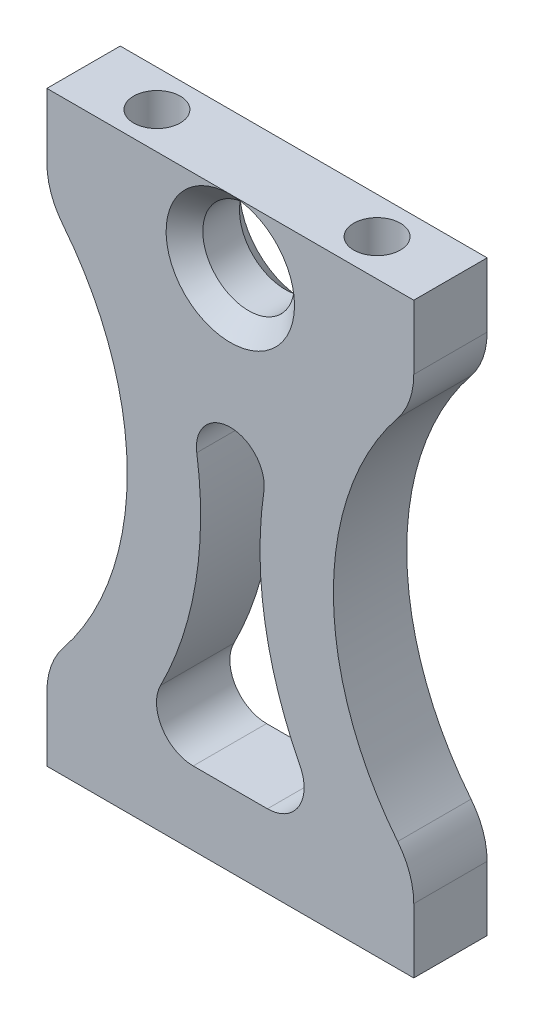
ISO-10303-21;
HEADER;
FILE_DESCRIPTION(('STEP AP214'),'2;1');
FILE_NAME('part.step','',(''),(''),'','','');
FILE_SCHEMA(('AUTOMOTIVE_DESIGN { 1 0 10303 214 1 1 1 1 }'));
ENDSEC;
DATA;
#1=APPLICATION_CONTEXT('core data for automotive mechanical design processes');
#2=APPLICATION_PROTOCOL_DEFINITION('international standard','automotive_design',2000,#1);
#3=PRODUCT_CONTEXT('',#1,'mechanical');
#4=PRODUCT('Part','Part','',(#3));
#5=PRODUCT_RELATED_PRODUCT_CATEGORY('part','',(#4));
#6=PRODUCT_DEFINITION_FORMATION('','',#4);
#7=PRODUCT_DEFINITION_CONTEXT('part definition',#1,'design');
#8=PRODUCT_DEFINITION('design','',#6,#7);
#9=PRODUCT_DEFINITION_SHAPE('','',#8);
#10=(LENGTH_UNIT() NAMED_UNIT(*) SI_UNIT(.MILLI.,.METRE.));
#11=(NAMED_UNIT(*) PLANE_ANGLE_UNIT() SI_UNIT($,.RADIAN.));
#12=(NAMED_UNIT(*) SI_UNIT($,.STERADIAN.) SOLID_ANGLE_UNIT());
#13=UNCERTAINTY_MEASURE_WITH_UNIT(LENGTH_MEASURE(1.E-05),#10,'distance_accuracy_value','');
#14=(GEOMETRIC_REPRESENTATION_CONTEXT(3) GLOBAL_UNCERTAINTY_ASSIGNED_CONTEXT((#13)) GLOBAL_UNIT_ASSIGNED_CONTEXT((#10,
#11,#12)) REPRESENTATION_CONTEXT('',''));
#15=CARTESIAN_POINT('',(0.,0.,0.));
#16=DIRECTION('',(0.,0.,1.));
#17=DIRECTION('',(1.,0.,0.));
#18=AXIS2_PLACEMENT_3D('',#15,#16,#17);
#19=CARTESIAN_POINT('',(-2.90233974557993,4.58125496914174,-0.634999999999999));
#20=CARTESIAN_POINT('',(-2.90233974557993,4.58125496914174,-0.423333333333333));
#21=CARTESIAN_POINT('',(-2.90233974557993,4.58125496914173,-0.211666666666666));
#22=CARTESIAN_POINT('',(-2.90233974557993,4.58125496914173,2.11666666666666));
#23=CARTESIAN_POINT('',(-2.90233974557993,4.58125496914173,4.23333333333432));
#24=CARTESIAN_POINT('',(-2.90233974557993,4.58125496914173,6.56166666666657));
#25=CARTESIAN_POINT('',(-2.90233974557993,4.58125496914174,6.7733333333334));
#26=CARTESIAN_POINT('',(-2.90233974557993,4.58125496914174,6.985));
#27=CARTESIAN_POINT('',(-3.21124312682717,6.69968043233277,-0.634999999999999));
#28=CARTESIAN_POINT('',(-3.21124312682717,6.69968043233277,-0.423333333333333));
#29=CARTESIAN_POINT('',(-3.21124312682717,6.69968043233277,-0.211666666666666));
#30=CARTESIAN_POINT('',(-3.21124312682717,6.69968043233277,2.11666666666666));
#31=CARTESIAN_POINT('',(-3.21124312682717,6.69968043233277,4.23333333333432));
#32=CARTESIAN_POINT('',(-3.21124312682717,6.69968043233277,6.56166666666657));
#33=CARTESIAN_POINT('',(-3.21124312682717,6.69968043233277,6.7733333333334));
#34=CARTESIAN_POINT('',(-3.21124312682717,6.69968043233277,6.985));
#35=CARTESIAN_POINT('',(-1.85201486307622,10.0791568100759,-0.634999999999999));
#36=CARTESIAN_POINT('',(-1.85201486307622,10.0791568100759,-0.423333333333333));
#37=CARTESIAN_POINT('',(-1.85201486307623,10.0791568100759,-0.211666666666666));
#38=CARTESIAN_POINT('',(-1.85201486307623,10.0791568100759,2.11666666666666));
#39=CARTESIAN_POINT('',(-1.85201486307623,10.0791568100759,4.23333333333432));
#40=CARTESIAN_POINT('',(-1.85201486307623,10.0791568100759,6.56166666666657));
#41=CARTESIAN_POINT('',(-1.85201486307622,10.0791568100759,6.7733333333334));
#42=CARTESIAN_POINT('',(-1.85201486307622,10.0791568100759,6.985));
#43=CARTESIAN_POINT('',(1.85201486307625,10.0791568100759,-0.634999999999999));
#44=CARTESIAN_POINT('',(1.85201486307625,10.0791568100759,-0.423333333333333));
#45=CARTESIAN_POINT('',(1.85201486307625,10.0791568100759,-0.211666666666666));
#46=CARTESIAN_POINT('',(1.85201486307625,10.0791568100759,2.11666666666666));
#47=CARTESIAN_POINT('',(1.85201486307625,10.0791568100759,4.23333333333432));
#48=CARTESIAN_POINT('',(1.85201486307625,10.0791568100759,6.56166666666657));
#49=CARTESIAN_POINT('',(1.85201486307625,10.0791568100759,6.7733333333334));
#50=CARTESIAN_POINT('',(1.85201486307625,10.0791568100759,6.985));
#51=CARTESIAN_POINT('',(3.21124312682719,6.69968043233276,-0.634999999999999));
#52=CARTESIAN_POINT('',(3.21124312682719,6.69968043233276,-0.423333333333333));
#53=CARTESIAN_POINT('',(3.21124312682718,6.69968043233276,-0.211666666666666));
#54=CARTESIAN_POINT('',(3.21124312682718,6.69968043233276,2.11666666666666));
#55=CARTESIAN_POINT('',(3.21124312682718,6.69968043233276,4.23333333333432));
#56=CARTESIAN_POINT('',(3.21124312682718,6.69968043233276,6.56166666666657));
#57=CARTESIAN_POINT('',(3.21124312682719,6.69968043233276,6.7733333333334));
#58=CARTESIAN_POINT('',(3.21124312682719,6.69968043233276,6.985));
#59=CARTESIAN_POINT('',(2.90233974557994,4.58125496914173,-0.634999999999999));
#60=CARTESIAN_POINT('',(2.90233974557994,4.58125496914173,-0.423333333333333));
#61=CARTESIAN_POINT('',(2.90233974557994,4.58125496914173,-0.211666666666666));
#62=CARTESIAN_POINT('',(2.90233974557994,4.58125496914173,2.11666666666666));
#63=CARTESIAN_POINT('',(2.90233974557994,4.58125496914173,4.23333333333432));
#64=CARTESIAN_POINT('',(2.90233974557994,4.58125496914173,6.56166666666657));
#65=CARTESIAN_POINT('',(2.90233974557994,4.58125496914173,6.7733333333334));
#66=CARTESIAN_POINT('',(2.90233974557994,4.58125496914173,6.985));
#67=(BOUNDED_SURFACE() B_SPLINE_SURFACE(5,3,((#19,#20,#21,#22,#23,#24,#25,#26),(#27,#28,#29,#30,
#31,#32,#33,#34),(#35,#36,#37,#38,#39,#40,#41,#42),(#43,#44,#45,#46,#47,#48,#49,#50),(#51,#52,
#53,#54,#55,#56,#57,#58),(#59,#60,#61,#62,#63,#64,#65,#66)),.UNSPECIFIED.,.F.,.F.,
.F.) B_SPLINE_SURFACE_WITH_KNOTS((6,6),(4,2,2,4),(0.,1.),(-0.1,0.,1.,1.1),
.UNSPECIFIED.) GEOMETRIC_REPRESENTATION_ITEM() RATIONAL_B_SPLINE_SURFACE(((1.,1.,1.,1.,1.,1.,1.,
1.),(0.542283401963566,0.542283401963566,0.542283401963566,0.542283401963566,0.542283401963566,
0.542283401963566,0.542283401963566,0.542283401963566),(0.31342510294535,0.31342510294535,
0.313425102945349,0.313425102945349,0.313425102945349,0.313425102945349,0.31342510294535,
0.31342510294535),(0.31342510294535,0.31342510294535,0.313425102945349,0.313425102945349,
0.313425102945349,0.313425102945349,0.31342510294535,0.31342510294535),(0.542283401963566,
0.542283401963566,0.542283401963566,0.542283401963566,0.542283401963566,0.542283401963566,
0.542283401963566,0.542283401963566),(1.,1.,1.,1.,1.,1.,1.,1.))) REPRESENTATION_ITEM('') SURFACE());
#68=CARTESIAN_POINT('',(2.90233974557994,4.58125496914173,-0.634999999999999));
#69=CARTESIAN_POINT('',(2.90233974557994,4.58125496914173,-0.423333333333333));
#70=CARTESIAN_POINT('',(2.90233974557994,4.58125496914173,-0.211666666666666));
#71=CARTESIAN_POINT('',(2.90233974557994,4.58125496914173,2.11666666666666));
#72=CARTESIAN_POINT('',(2.90233974557994,4.58125496914173,4.23333333333432));
#73=CARTESIAN_POINT('',(2.90233974557994,4.58125496914173,6.56166666666657));
#74=CARTESIAN_POINT('',(2.90233974557994,4.58125496914173,6.7733333333334));
#75=CARTESIAN_POINT('',(2.90233974557994,4.58125496914173,6.985));
#76=(BOUNDED_CURVE() B_SPLINE_CURVE(3,(#68,#69,#70,#71,#72,#73,#74,#75),.UNSPECIFIED.,.F.,
.F.) B_SPLINE_CURVE_WITH_KNOTS((4,2,2,4),(-0.1,0.,1.,1.1),
.UNSPECIFIED.) CURVE() GEOMETRIC_REPRESENTATION_ITEM() RATIONAL_B_SPLINE_CURVE((1.,1.,1.,1.,1.,
1.,1.,1.)) REPRESENTATION_ITEM(''));
#77=CARTESIAN_POINT('',(2.90233974557994,4.58125496914172,6.35));
#78=VERTEX_POINT('',#77);
#79=CARTESIAN_POINT('',(2.90233974557994,4.58125496914172,0.));
#80=VERTEX_POINT('',#79);
#81=EDGE_CURVE('E320',#78,#80,#76,.F.);
#82=CARTESIAN_POINT('',(2.90233974557994,4.58125496914173,6.35));
#83=CARTESIAN_POINT('',(3.21124312682718,6.69968043233276,6.35));
#84=CARTESIAN_POINT('',(1.85201486307625,10.0791568100759,6.35));
#85=CARTESIAN_POINT('',(-1.85201486307623,10.0791568100759,6.35));
#86=CARTESIAN_POINT('',(-3.21124312682717,6.69968043233276,6.35));
#87=CARTESIAN_POINT('',(-2.90233974557993,4.58125496914173,6.35));
#88=(BOUNDED_CURVE() B_SPLINE_CURVE(5,(#82,#83,#84,#85,#86,#87),.UNSPECIFIED.,.F.,
.F.) B_SPLINE_CURVE_WITH_KNOTS((6,6),(0.,1.),
.UNSPECIFIED.) CURVE() GEOMETRIC_REPRESENTATION_ITEM() RATIONAL_B_SPLINE_CURVE((1.,
0.542283401963566,0.313425102945349,0.313425102945349,0.542283401963566,1.)) REPRESENTATION_ITEM(''));
#89=CARTESIAN_POINT('',(-2.90233974557993,4.58125496914174,6.35));
#90=VERTEX_POINT('',#89);
#91=EDGE_CURVE('E51',#78,#90,#88,.T.);
#92=CARTESIAN_POINT('',(-2.90233974557993,4.58125496914174,6.985));
#93=CARTESIAN_POINT('',(-2.90233974557993,4.58125496914174,6.7733333333334));
#94=CARTESIAN_POINT('',(-2.90233974557993,4.58125496914173,6.56166666666657));
#95=CARTESIAN_POINT('',(-2.90233974557993,4.58125496914173,4.23333333333432));
#96=CARTESIAN_POINT('',(-2.90233974557993,4.58125496914173,2.11666666666666));
#97=CARTESIAN_POINT('',(-2.90233974557993,4.58125496914173,-0.211666666666666));
#98=CARTESIAN_POINT('',(-2.90233974557993,4.58125496914174,-0.423333333333333));
#99=CARTESIAN_POINT('',(-2.90233974557993,4.58125496914174,-0.634999999999999));
#100=(BOUNDED_CURVE() B_SPLINE_CURVE(3,(#92,#93,#94,#95,#96,#97,#98,#99),.UNSPECIFIED.,.F.,
.F.) B_SPLINE_CURVE_WITH_KNOTS((4,2,2,4),(-0.1,0.,1.,1.1),
.UNSPECIFIED.) CURVE() GEOMETRIC_REPRESENTATION_ITEM() RATIONAL_B_SPLINE_CURVE((1.,1.,1.,1.,1.,
1.,1.,1.)) REPRESENTATION_ITEM(''));
#101=CARTESIAN_POINT('',(-2.90233974557993,4.58125496914174,0.));
#102=VERTEX_POINT('',#101);
#103=EDGE_CURVE('E237',#102,#90,#100,.F.);
#104=CARTESIAN_POINT('',(-2.90233974557993,4.58125496914173,0.));
#105=CARTESIAN_POINT('',(-3.21124312682717,6.69968043233276,0.));
#106=CARTESIAN_POINT('',(-1.85201486307623,10.0791568100759,0.));
#107=CARTESIAN_POINT('',(1.85201486307625,10.0791568100759,0.));
#108=CARTESIAN_POINT('',(3.21124312682718,6.69968043233276,0.));
#109=CARTESIAN_POINT('',(2.90233974557994,4.58125496914173,0.));
#110=(BOUNDED_CURVE() B_SPLINE_CURVE(5,(#104,#105,#106,#107,#108,#109),.UNSPECIFIED.,.F.,
.F.) B_SPLINE_CURVE_WITH_KNOTS((6,6),(0.,1.),
.UNSPECIFIED.) CURVE() GEOMETRIC_REPRESENTATION_ITEM() RATIONAL_B_SPLINE_CURVE((1.,
0.542283401963566,0.313425102945349,0.313425102945349,0.542283401963566,1.)) REPRESENTATION_ITEM(''));
#111=EDGE_CURVE('E11',#102,#80,#110,.T.);
#112=ORIENTED_EDGE('',*,*,#81,.F.);
#113=ORIENTED_EDGE('',*,*,#91,.T.);
#114=ORIENTED_EDGE('',*,*,#103,.F.);
#115=ORIENTED_EDGE('',*,*,#111,.T.);
#116=EDGE_LOOP('',(#112,#113,#114,#115));
#117=FACE_BOUND('',#116,.T.);
#118=ADVANCED_FACE('F37',(#117),#67,.T.);
#119=CARTESIAN_POINT('',(0.,0.,6.35));
#120=DIRECTION('',(0.,0.,1.));
#121=DIRECTION('',(1.,0.,0.));
#122=AXIS2_PLACEMENT_3D('',#119,#120,#121);
#123=PLANE('',#122);
#124=CARTESIAN_POINT('',(34.3200831863128,0.,6.35));
#125=DIRECTION('',(0.,0.,1.));
#126=DIRECTION('',(1.,0.,0.));
#127=AXIS2_PLACEMENT_3D('',#124,#125,#126);
#128=CIRCLE('',#127,25.4);
#129=CARTESIAN_POINT('',(14.4840166372626,15.8647553987337,6.35));
#130=VERTEX_POINT('',#129);
#131=CARTESIAN_POINT('',(14.4840166372626,-15.8647553987336,6.35));
#132=VERTEX_POINT('',#131);
#133=EDGE_CURVE('E456',#130,#132,#128,.T.);
#134=ORIENTED_EDGE('',*,*,#133,.F.);
#135=CARTESIAN_POINT('',(9.52499999999999,19.8309442484171,6.35));
#136=DIRECTION('',(0.,0.,1.));
#137=DIRECTION('',(1.,0.,0.));
#138=AXIS2_PLACEMENT_3D('',#135,#136,#137);
#139=CIRCLE('',#138,6.35);
#140=CARTESIAN_POINT('',(15.875,19.8309442484171,6.35));
#141=VERTEX_POINT('',#140);
#142=EDGE_CURVE('E372',#130,#141,#139,.T.);
#143=ORIENTED_EDGE('',*,*,#142,.T.);
#144=DIRECTION('',(0.,1.,0.));
#145=VECTOR('',#144,1.);
#146=CARTESIAN_POINT('',(15.875,25.4,6.35));
#147=LINE('',#146,#145);
#148=CARTESIAN_POINT('',(15.875,25.4,6.35));
#149=VERTEX_POINT('',#148);
#150=EDGE_CURVE('E412',#141,#149,#147,.T.);
#151=ORIENTED_EDGE('',*,*,#150,.T.);
#152=DIRECTION('',(-1.,0.,0.));
#153=VECTOR('',#152,1.);
#154=CARTESIAN_POINT('',(-15.875,25.4,6.35));
#155=LINE('',#154,#153);
#156=CARTESIAN_POINT('',(0.,25.4,6.35));
#157=VERTEX_POINT('',#156);
#158=EDGE_CURVE('E430',#149,#157,#155,.T.);
#159=ORIENTED_EDGE('',*,*,#158,.T.);
#160=CARTESIAN_POINT('',(0.,19.84375,6.35));
#161=DIRECTION('',(0.,0.,1.));
#162=DIRECTION('',(1.,0.,0.));
#163=AXIS2_PLACEMENT_3D('',#160,#161,#162);
#164=CIRCLE('',#163,5.55625000000001);
#165=EDGE_CURVE('E385',#157,#157,#164,.F.);
#166=ORIENTED_EDGE('',*,*,#165,.T.);
#167=CARTESIAN_POINT('',(-15.875,25.4,6.35));
#168=VERTEX_POINT('',#167);
#169=EDGE_CURVE('E433',#157,#168,#155,.T.);
#170=ORIENTED_EDGE('',*,*,#169,.T.);
#171=DIRECTION('',(0.,-1.,0.));
#172=VECTOR('',#171,1.);
#173=CARTESIAN_POINT('',(-15.875,25.4,6.35));
#174=LINE('',#173,#172);
#175=CARTESIAN_POINT('',(-15.875,19.8309442484171,6.35));
#176=VERTEX_POINT('',#175);
#177=EDGE_CURVE('E426',#168,#176,#174,.T.);
#178=ORIENTED_EDGE('',*,*,#177,.T.);
#179=CARTESIAN_POINT('',(-9.52500000000001,19.8309442484171,6.35));
#180=DIRECTION('',(0.,0.,1.));
#181=DIRECTION('',(1.,0.,0.));
#182=AXIS2_PLACEMENT_3D('',#179,#180,#181);
#183=CIRCLE('',#182,6.35);
#184=CARTESIAN_POINT('',(-14.4840166372626,15.8647553987337,6.35));
#185=VERTEX_POINT('',#184);
#186=EDGE_CURVE('E378',#176,#185,#183,.T.);
#187=ORIENTED_EDGE('',*,*,#186,.T.);
#188=CARTESIAN_POINT('',(-34.3200831863128,0.,6.35));
#189=DIRECTION('',(0.,0.,1.));
#190=DIRECTION('',(1.,0.,0.));
#191=AXIS2_PLACEMENT_3D('',#188,#189,#190);
#192=CIRCLE('',#191,25.4);
#193=CARTESIAN_POINT('',(-14.4840166372626,-15.8647553987337,6.35));
#194=VERTEX_POINT('',#193);
#195=EDGE_CURVE('E450',#185,#194,#192,.F.);
#196=ORIENTED_EDGE('',*,*,#195,.T.);
#197=CARTESIAN_POINT('',(-9.525,-19.8309442484171,6.35));
#198=DIRECTION('',(0.,0.,1.));
#199=DIRECTION('',(1.,0.,0.));
#200=AXIS2_PLACEMENT_3D('',#197,#198,#199);
#201=CIRCLE('',#200,6.35);
#202=CARTESIAN_POINT('',(-15.875,-19.8309442484171,6.35));
#203=VERTEX_POINT('',#202);
#204=EDGE_CURVE('E376',#194,#203,#201,.T.);
#205=ORIENTED_EDGE('',*,*,#204,.T.);
#206=CARTESIAN_POINT('',(-15.875,-25.4,6.35));
#207=VERTEX_POINT('',#206);
#208=EDGE_CURVE('E429',#203,#207,#174,.T.);
#209=ORIENTED_EDGE('',*,*,#208,.T.);
#210=DIRECTION('',(1.,0.,0.));
#211=VECTOR('',#210,1.);
#212=CARTESIAN_POINT('',(-15.875,-25.4,6.35));
#213=LINE('',#212,#211);
#214=CARTESIAN_POINT('',(15.875,-25.4,6.35));
#215=VERTEX_POINT('',#214);
#216=EDGE_CURVE('E409',#207,#215,#213,.T.);
#217=ORIENTED_EDGE('',*,*,#216,.T.);
#218=CARTESIAN_POINT('',(15.875,-19.8309442484171,6.35));
#219=VERTEX_POINT('',#218);
#220=EDGE_CURVE('E434',#215,#219,#147,.T.);
#221=ORIENTED_EDGE('',*,*,#220,.T.);
#222=CARTESIAN_POINT('',(9.525,-19.8309442484171,6.35));
#223=DIRECTION('',(0.,0.,1.));
#224=DIRECTION('',(1.,0.,0.));
#225=AXIS2_PLACEMENT_3D('',#222,#223,#224);
#226=CIRCLE('',#225,6.35);
#227=EDGE_CURVE('E374',#219,#132,#226,.T.);
#228=ORIENTED_EDGE('',*,*,#227,.T.);
#229=EDGE_LOOP('',(#134,#143,#151,#159,#166,#170,#178,#187,#196,#205,#209,#217,#221,#228));
#230=FACE_BOUND('',#229,.T.);
#231=CARTESIAN_POINT('',(34.3200831863128,0.,6.35));
#232=DIRECTION('',(0.,0.,-1.));
#233=DIRECTION('',(1.,0.,0.));
#234=AXIS2_PLACEMENT_3D('',#231,#232,#233);
#235=CIRCLE('',#234,31.75);
#236=CARTESIAN_POINT('',(6.0396107014525,-14.4318181818182,6.35));
#237=VERTEX_POINT('',#236);
#238=EDGE_CURVE('E203',#237,#78,#235,.T.);
#239=ORIENTED_EDGE('',*,*,#238,.F.);
#240=CARTESIAN_POINT('',(3.21156345296647,-15.875,6.35));
#241=DIRECTION('',(0.,0.,1.));
#242=DIRECTION('',(1.,0.,0.));
#243=AXIS2_PLACEMENT_3D('',#240,#241,#242);
#244=CIRCLE('',#243,3.175);
#245=CARTESIAN_POINT('',(3.21156345296647,-19.05,6.35));
#246=VERTEX_POINT('',#245);
#247=EDGE_CURVE('E334',#237,#246,#244,.F.);
#248=ORIENTED_EDGE('',*,*,#247,.T.);
#249=DIRECTION('',(1.,0.,0.));
#250=VECTOR('',#249,1.);
#251=CARTESIAN_POINT('',(-8.92008318631281,-19.05,6.35));
#252=LINE('',#251,#250);
#253=CARTESIAN_POINT('',(-3.21156345296645,-19.05,6.35));
#254=VERTEX_POINT('',#253);
#255=EDGE_CURVE('E213',#254,#246,#252,.T.);
#256=ORIENTED_EDGE('',*,*,#255,.F.);
#257=CARTESIAN_POINT('',(-3.21156345296645,-15.875,6.35));
#258=DIRECTION('',(0.,0.,1.));
#259=DIRECTION('',(1.,0.,0.));
#260=AXIS2_PLACEMENT_3D('',#257,#258,#259);
#261=CIRCLE('',#260,3.175);
#262=CARTESIAN_POINT('',(-6.03961070145248,-14.4318181818182,6.35));
#263=VERTEX_POINT('',#262);
#264=EDGE_CURVE('E333',#254,#263,#261,.F.);
#265=ORIENTED_EDGE('',*,*,#264,.T.);
#266=CARTESIAN_POINT('',(-34.3200831863128,0.,6.35));
#267=DIRECTION('',(0.,0.,-1.));
#268=DIRECTION('',(1.,0.,0.));
#269=AXIS2_PLACEMENT_3D('',#266,#267,#268);
#270=CIRCLE('',#269,31.75);
#271=EDGE_CURVE('E219',#90,#263,#270,.T.);
#272=ORIENTED_EDGE('',*,*,#271,.F.);
#273=ORIENTED_EDGE('',*,*,#91,.F.);
#274=EDGE_LOOP('',(#239,#248,#256,#265,#272,#273));
#275=FACE_BOUND('',#274,.T.);
#276=ADVANCED_FACE('F294',(#230,#275),#123,.T.);
#277=CARTESIAN_POINT('',(0.,0.,0.));
#278=DIRECTION('',(0.,0.,1.));
#279=DIRECTION('',(1.,0.,0.));
#280=AXIS2_PLACEMENT_3D('',#277,#278,#279);
#281=PLANE('',#280);
#282=ORIENTED_EDGE('',*,*,#111,.F.);
#283=CARTESIAN_POINT('',(-34.3200831863128,0.,0.));
#284=DIRECTION('',(0.,0.,-1.));
#285=DIRECTION('',(1.,0.,0.));
#286=AXIS2_PLACEMENT_3D('',#283,#284,#285);
#287=CIRCLE('',#286,31.75);
#288=CARTESIAN_POINT('',(-6.03961070145248,-14.4318181818182,0.));
#289=VERTEX_POINT('',#288);
#290=EDGE_CURVE('E212',#102,#289,#287,.T.);
#291=ORIENTED_EDGE('',*,*,#290,.T.);
#292=CARTESIAN_POINT('',(-3.21156345296645,-15.875,0.));
#293=DIRECTION('',(0.,0.,1.));
#294=DIRECTION('',(1.,0.,0.));
#295=AXIS2_PLACEMENT_3D('',#292,#293,#294);
#296=CIRCLE('',#295,3.175);
#297=CARTESIAN_POINT('',(-3.21156345296645,-19.05,0.));
#298=VERTEX_POINT('',#297);
#299=EDGE_CURVE('E214',#289,#298,#296,.T.);
#300=ORIENTED_EDGE('',*,*,#299,.T.);
#301=DIRECTION('',(1.,0.,0.));
#302=VECTOR('',#301,1.);
#303=CARTESIAN_POINT('',(-8.92008318631281,-19.05,0.));
#304=LINE('',#303,#302);
#305=CARTESIAN_POINT('',(3.21156345296647,-19.05,0.));
#306=VERTEX_POINT('',#305);
#307=EDGE_CURVE('E224',#298,#306,#304,.T.);
#308=ORIENTED_EDGE('',*,*,#307,.T.);
#309=CARTESIAN_POINT('',(3.21156345296647,-15.875,0.));
#310=DIRECTION('',(0.,0.,1.));
#311=DIRECTION('',(1.,0.,0.));
#312=AXIS2_PLACEMENT_3D('',#309,#310,#311);
#313=CIRCLE('',#312,3.175);
#314=CARTESIAN_POINT('',(6.0396107014525,-14.4318181818182,0.));
#315=VERTEX_POINT('',#314);
#316=EDGE_CURVE('E329',#306,#315,#313,.T.);
#317=ORIENTED_EDGE('',*,*,#316,.T.);
#318=CARTESIAN_POINT('',(34.3200831863128,0.,0.));
#319=DIRECTION('',(0.,0.,-1.));
#320=DIRECTION('',(1.,0.,0.));
#321=AXIS2_PLACEMENT_3D('',#318,#319,#320);
#322=CIRCLE('',#321,31.75);
#323=EDGE_CURVE('E209',#315,#80,#322,.T.);
#324=ORIENTED_EDGE('',*,*,#323,.T.);
#325=EDGE_LOOP('',(#282,#291,#300,#308,#317,#324));
#326=FACE_BOUND('',#325,.T.);
#327=DIRECTION('',(0.,1.,0.));
#328=VECTOR('',#327,1.);
#329=CARTESIAN_POINT('',(15.875,25.4,0.));
#330=LINE('',#329,#328);
#331=CARTESIAN_POINT('',(15.875,19.8309442484171,0.));
#332=VERTEX_POINT('',#331);
#333=CARTESIAN_POINT('',(15.875,25.4,0.));
#334=VERTEX_POINT('',#333);
#335=EDGE_CURVE('E424',#332,#334,#330,.T.);
#336=ORIENTED_EDGE('',*,*,#335,.F.);
#337=CARTESIAN_POINT('',(9.52499999999999,19.8309442484171,0.));
#338=DIRECTION('',(0.,0.,1.));
#339=DIRECTION('',(1.,0.,0.));
#340=AXIS2_PLACEMENT_3D('',#337,#338,#339);
#341=CIRCLE('',#340,6.35);
#342=CARTESIAN_POINT('',(14.4840166372626,15.8647553987337,0.));
#343=VERTEX_POINT('',#342);
#344=EDGE_CURVE('E362',#332,#343,#341,.F.);
#345=ORIENTED_EDGE('',*,*,#344,.T.);
#346=CARTESIAN_POINT('',(34.3200831863128,0.,0.));
#347=DIRECTION('',(0.,0.,1.));
#348=DIRECTION('',(1.,0.,0.));
#349=AXIS2_PLACEMENT_3D('',#346,#347,#348);
#350=CIRCLE('',#349,25.4);
#351=CARTESIAN_POINT('',(14.4840166372626,-15.8647553987336,0.));
#352=VERTEX_POINT('',#351);
#353=EDGE_CURVE('E449',#343,#352,#350,.T.);
#354=ORIENTED_EDGE('',*,*,#353,.T.);
#355=CARTESIAN_POINT('',(9.525,-19.8309442484171,0.));
#356=DIRECTION('',(0.,0.,1.));
#357=DIRECTION('',(1.,0.,0.));
#358=AXIS2_PLACEMENT_3D('',#355,#356,#357);
#359=CIRCLE('',#358,6.35);
#360=CARTESIAN_POINT('',(15.875,-19.8309442484171,0.));
#361=VERTEX_POINT('',#360);
#362=EDGE_CURVE('E364',#352,#361,#359,.F.);
#363=ORIENTED_EDGE('',*,*,#362,.T.);
#364=CARTESIAN_POINT('',(15.875,-25.4,0.));
#365=VERTEX_POINT('',#364);
#366=EDGE_CURVE('E421',#365,#361,#330,.T.);
#367=ORIENTED_EDGE('',*,*,#366,.F.);
#368=DIRECTION('',(1.,0.,0.));
#369=VECTOR('',#368,1.);
#370=CARTESIAN_POINT('',(-15.875,-25.4,0.));
#371=LINE('',#370,#369);
#372=CARTESIAN_POINT('',(-15.875,-25.4,0.));
#373=VERTEX_POINT('',#372);
#374=EDGE_CURVE('E410',#373,#365,#371,.T.);
#375=ORIENTED_EDGE('',*,*,#374,.F.);
#376=DIRECTION('',(0.,-1.,0.));
#377=VECTOR('',#376,1.);
#378=CARTESIAN_POINT('',(-15.875,25.4,0.));
#379=LINE('',#378,#377);
#380=CARTESIAN_POINT('',(-15.875,-19.8309442484171,0.));
#381=VERTEX_POINT('',#380);
#382=EDGE_CURVE('E416',#381,#373,#379,.T.);
#383=ORIENTED_EDGE('',*,*,#382,.F.);
#384=CARTESIAN_POINT('',(-9.525,-19.8309442484171,0.));
#385=DIRECTION('',(0.,0.,1.));
#386=DIRECTION('',(1.,0.,0.));
#387=AXIS2_PLACEMENT_3D('',#384,#385,#386);
#388=CIRCLE('',#387,6.35);
#389=CARTESIAN_POINT('',(-14.4840166372626,-15.8647553987337,0.));
#390=VERTEX_POINT('',#389);
#391=EDGE_CURVE('E366',#381,#390,#388,.F.);
#392=ORIENTED_EDGE('',*,*,#391,.T.);
#393=CARTESIAN_POINT('',(-34.3200831863128,0.,0.));
#394=DIRECTION('',(0.,0.,1.));
#395=DIRECTION('',(1.,0.,0.));
#396=AXIS2_PLACEMENT_3D('',#393,#394,#395);
#397=CIRCLE('',#396,25.4);
#398=CARTESIAN_POINT('',(-14.4840166372626,15.8647553987337,0.));
#399=VERTEX_POINT('',#398);
#400=EDGE_CURVE('E453',#399,#390,#397,.F.);
#401=ORIENTED_EDGE('',*,*,#400,.F.);
#402=CARTESIAN_POINT('',(-9.52500000000001,19.8309442484171,0.));
#403=DIRECTION('',(0.,0.,1.));
#404=DIRECTION('',(1.,0.,0.));
#405=AXIS2_PLACEMENT_3D('',#402,#403,#404);
#406=CIRCLE('',#405,6.35);
#407=CARTESIAN_POINT('',(-15.875,19.8309442484171,0.));
#408=VERTEX_POINT('',#407);
#409=EDGE_CURVE('E368',#399,#408,#406,.F.);
#410=ORIENTED_EDGE('',*,*,#409,.T.);
#411=CARTESIAN_POINT('',(-15.875,25.4,0.));
#412=VERTEX_POINT('',#411);
#413=EDGE_CURVE('E413',#412,#408,#379,.T.);
#414=ORIENTED_EDGE('',*,*,#413,.F.);
#415=DIRECTION('',(-1.,0.,0.));
#416=VECTOR('',#415,1.);
#417=CARTESIAN_POINT('',(-15.875,25.4,0.));
#418=LINE('',#417,#416);
#419=CARTESIAN_POINT('',(0.,25.4,0.));
#420=VERTEX_POINT('',#419);
#421=EDGE_CURVE('E420',#420,#412,#418,.T.);
#422=ORIENTED_EDGE('',*,*,#421,.F.);
#423=CARTESIAN_POINT('',(0.,19.84375,0.));
#424=DIRECTION('',(0.,0.,1.));
#425=DIRECTION('',(1.,0.,0.));
#426=AXIS2_PLACEMENT_3D('',#423,#424,#425);
#427=CIRCLE('',#426,5.55625);
#428=EDGE_CURVE('E394',#420,#420,#427,.T.);
#429=ORIENTED_EDGE('',*,*,#428,.T.);
#430=EDGE_CURVE('E417',#334,#420,#418,.T.);
#431=ORIENTED_EDGE('',*,*,#430,.F.);
#432=EDGE_LOOP('',(#336,#345,#354,#363,#367,#375,#383,#392,#401,#410,#414,#422,#429,#431));
#433=FACE_BOUND('',#432,.T.);
#434=ADVANCED_FACE('F297',(#326,#433),#281,.F.);
#435=CARTESIAN_POINT('',(15.875,25.4,6.35));
#436=DIRECTION('',(-1.,0.,0.));
#437=DIRECTION('',(0.,-1.,0.));
#438=AXIS2_PLACEMENT_3D('',#435,#436,#437);
#439=PLANE('',#438);
#440=ORIENTED_EDGE('',*,*,#366,.T.);
#441=DIRECTION('',(0.,0.,1.));
#442=VECTOR('',#441,1.);
#443=CARTESIAN_POINT('',(15.875,-19.8309442484171,6.35));
#444=LINE('',#443,#442);
#445=EDGE_CURVE('E359',#361,#219,#444,.T.);
#446=ORIENTED_EDGE('',*,*,#445,.T.);
#447=ORIENTED_EDGE('',*,*,#220,.F.);
#448=DIRECTION('',(0.,0.,-1.));
#449=VECTOR('',#448,1.);
#450=CARTESIAN_POINT('',(15.875,-25.4,6.35));
#451=LINE('',#450,#449);
#452=EDGE_CURVE('E406',#215,#365,#451,.T.);
#453=ORIENTED_EDGE('',*,*,#452,.T.);
#454=EDGE_LOOP('',(#440,#446,#447,#453));
#455=FACE_BOUND('',#454,.T.);
#456=ADVANCED_FACE('F471',(#455),#439,.F.);
#457=CARTESIAN_POINT('',(-15.875,25.4,6.35));
#458=DIRECTION('',(1.,0.,0.));
#459=DIRECTION('',(0.,1.,0.));
#460=AXIS2_PLACEMENT_3D('',#457,#458,#459);
#461=PLANE('',#460);
#462=ORIENTED_EDGE('',*,*,#413,.T.);
#463=DIRECTION('',(0.,0.,-1.));
#464=VECTOR('',#463,1.);
#465=CARTESIAN_POINT('',(-15.875,19.8309442484171,6.35));
#466=LINE('',#465,#464);
#467=EDGE_CURVE('E349',#408,#176,#466,.F.);
#468=ORIENTED_EDGE('',*,*,#467,.T.);
#469=ORIENTED_EDGE('',*,*,#177,.F.);
#470=DIRECTION('',(0.,0.,-1.));
#471=VECTOR('',#470,1.);
#472=CARTESIAN_POINT('',(-15.875,25.4,6.35));
#473=LINE('',#472,#471);
#474=EDGE_CURVE('E400',#168,#412,#473,.T.);
#475=ORIENTED_EDGE('',*,*,#474,.T.);
#476=EDGE_LOOP('',(#462,#468,#469,#475));
#477=FACE_BOUND('',#476,.T.);
#478=ADVANCED_FACE('F495',(#477),#461,.F.);
#479=ORIENTED_EDGE('',*,*,#208,.F.);
#480=DIRECTION('',(0.,0.,-1.));
#481=VECTOR('',#480,1.);
#482=CARTESIAN_POINT('',(-15.875,-19.8309442484171,0.));
#483=LINE('',#482,#481);
#484=EDGE_CURVE('E352',#203,#381,#483,.T.);
#485=ORIENTED_EDGE('',*,*,#484,.T.);
#486=ORIENTED_EDGE('',*,*,#382,.T.);
#487=DIRECTION('',(0.,0.,-1.));
#488=VECTOR('',#487,1.);
#489=CARTESIAN_POINT('',(-15.875,-25.4,6.35));
#490=LINE('',#489,#488);
#491=EDGE_CURVE('E403',#207,#373,#490,.T.);
#492=ORIENTED_EDGE('',*,*,#491,.F.);
#493=EDGE_LOOP('',(#479,#485,#486,#492));
#494=FACE_BOUND('',#493,.T.);
#495=ADVANCED_FACE('F510',(#494),#461,.F.);
#496=ORIENTED_EDGE('',*,*,#150,.F.);
#497=DIRECTION('',(0.,0.,1.));
#498=VECTOR('',#497,1.);
#499=CARTESIAN_POINT('',(15.875,19.8309442484171,6.35));
#500=LINE('',#499,#498);
#501=EDGE_CURVE('E370',#141,#332,#500,.F.);
#502=ORIENTED_EDGE('',*,*,#501,.T.);
#503=ORIENTED_EDGE('',*,*,#335,.T.);
#504=DIRECTION('',(0.,0.,-1.));
#505=VECTOR('',#504,1.);
#506=CARTESIAN_POINT('',(15.875,25.4,6.35));
#507=LINE('',#506,#505);
#508=EDGE_CURVE('E397',#149,#334,#507,.T.);
#509=ORIENTED_EDGE('',*,*,#508,.F.);
#510=EDGE_LOOP('',(#496,#502,#503,#509));
#511=FACE_BOUND('',#510,.T.);
#512=ADVANCED_FACE('F508',(#511),#439,.F.);
#513=CARTESIAN_POINT('',(-15.875,25.4,6.35));
#514=DIRECTION('',(0.,-1.,0.));
#515=DIRECTION('',(0.,0.,-1.));
#516=AXIS2_PLACEMENT_3D('',#513,#514,#515);
#517=PLANE('',#516);
#518=CARTESIAN_POINT('',(-9.52500000000001,25.4,3.175));
#519=DIRECTION('',(0.,1.,0.));
#520=DIRECTION('',(0.,0.,1.));
#521=AXIS2_PLACEMENT_3D('',#518,#519,#520);
#522=CIRCLE('',#521,2.0193);
#523=CARTESIAN_POINT('',(-9.52500000000001,25.4,5.1943));
#524=VERTEX_POINT('',#523);
#525=EDGE_CURVE('E446',#524,#524,#522,.T.);
#526=ORIENTED_EDGE('',*,*,#525,.F.);
#527=EDGE_LOOP('',(#526));
#528=FACE_BOUND('',#527,.T.);
#529=CARTESIAN_POINT('',(9.52499999999999,25.4,3.175));
#530=DIRECTION('',(0.,1.,0.));
#531=DIRECTION('',(0.,0.,1.));
#532=AXIS2_PLACEMENT_3D('',#529,#530,#531);
#533=CIRCLE('',#532,2.0193);
#534=CARTESIAN_POINT('',(9.52499999999999,25.4,5.1943));
#535=VERTEX_POINT('',#534);
#536=EDGE_CURVE('E440',#535,#535,#533,.T.);
#537=ORIENTED_EDGE('',*,*,#536,.F.);
#538=EDGE_LOOP('',(#537));
#539=FACE_BOUND('',#538,.T.);
#540=ORIENTED_EDGE('',*,*,#430,.T.);
#541=ORIENTED_EDGE('',*,*,#421,.T.);
#542=ORIENTED_EDGE('',*,*,#474,.F.);
#543=ORIENTED_EDGE('',*,*,#169,.F.);
#544=ORIENTED_EDGE('',*,*,#158,.F.);
#545=ORIENTED_EDGE('',*,*,#508,.T.);
#546=EDGE_LOOP('',(#540,#541,#542,#543,#544,#545));
#547=FACE_BOUND('',#546,.T.);
#548=ADVANCED_FACE('F501',(#528,#539,#547),#517,.F.);
#549=CARTESIAN_POINT('',(-15.875,-25.4,6.35));
#550=DIRECTION('',(0.,1.,0.));
#551=DIRECTION('',(0.,0.,1.));
#552=AXIS2_PLACEMENT_3D('',#549,#550,#551);
#553=PLANE('',#552);
#554=CARTESIAN_POINT('',(-9.52500000000001,-25.4,3.175));
#555=DIRECTION('',(0.,-1.,0.));
#556=DIRECTION('',(0.,0.,-1.));
#557=AXIS2_PLACEMENT_3D('',#554,#555,#556);
#558=CIRCLE('',#557,2.0193);
#559=CARTESIAN_POINT('',(-9.52500000000001,-25.4,1.15570000000001));
#560=VERTEX_POINT('',#559);
#561=EDGE_CURVE('E193',#560,#560,#558,.T.);
#562=ORIENTED_EDGE('',*,*,#561,.F.);
#563=EDGE_LOOP('',(#562));
#564=FACE_BOUND('',#563,.T.);
#565=CARTESIAN_POINT('',(9.52499999999999,-25.4,3.175));
#566=DIRECTION('',(0.,-1.,0.));
#567=DIRECTION('',(0.,0.,-1.));
#568=AXIS2_PLACEMENT_3D('',#565,#566,#567);
#569=CIRCLE('',#568,2.0193);
#570=CARTESIAN_POINT('',(9.52499999999999,-25.4,1.15570000000001));
#571=VERTEX_POINT('',#570);
#572=EDGE_CURVE('E192',#571,#571,#569,.T.);
#573=ORIENTED_EDGE('',*,*,#572,.F.);
#574=EDGE_LOOP('',(#573));
#575=FACE_BOUND('',#574,.T.);
#576=ORIENTED_EDGE('',*,*,#374,.T.);
#577=ORIENTED_EDGE('',*,*,#452,.F.);
#578=ORIENTED_EDGE('',*,*,#216,.F.);
#579=ORIENTED_EDGE('',*,*,#491,.T.);
#580=EDGE_LOOP('',(#576,#577,#578,#579));
#581=FACE_BOUND('',#580,.T.);
#582=ADVANCED_FACE('F292',(#564,#575,#581),#553,.F.);
#583=CARTESIAN_POINT('',(9.52499999999999,15.748,3.175));
#584=DIRECTION('',(0.,1.,0.));
#585=DIRECTION('',(0.,0.,1.));
#586=AXIS2_PLACEMENT_3D('',#583,#584,#585);
#587=CONICAL_SURFACE('',#586,2.0193,1.02974425867665);
#588=CARTESIAN_POINT('',(9.52499999999999,14.5346821519977,3.175));
#589=VERTEX_POINT('',#588);
#590=VERTEX_LOOP('',#589);
#591=FACE_BOUND('',#590,.T.);
#592=CARTESIAN_POINT('',(9.52499999999999,15.748,3.175));
#593=DIRECTION('',(0.,1.,0.));
#594=DIRECTION('',(0.,0.,1.));
#595=AXIS2_PLACEMENT_3D('',#592,#593,#594);
#596=CIRCLE('',#595,2.0193);
#597=CARTESIAN_POINT('',(9.52499999999999,15.748,5.1943));
#598=VERTEX_POINT('',#597);
#599=EDGE_CURVE('E437',#598,#598,#596,.T.);
#600=ORIENTED_EDGE('',*,*,#599,.T.);
#601=EDGE_LOOP('',(#600));
#602=FACE_BOUND('',#601,.T.);
#603=ADVANCED_FACE('F288',(#591,#602),#587,.F.);
#604=CARTESIAN_POINT('',(9.52499999999999,25.4,3.175));
#605=DIRECTION('',(0.,1.,0.));
#606=DIRECTION('',(0.,0.,1.));
#607=AXIS2_PLACEMENT_3D('',#604,#605,#606);
#608=CYLINDRICAL_SURFACE('',#607,2.0193);
#609=ORIENTED_EDGE('',*,*,#599,.F.);
#610=EDGE_LOOP('',(#609));
#611=FACE_BOUND('',#610,.T.);
#612=ORIENTED_EDGE('',*,*,#536,.T.);
#613=EDGE_LOOP('',(#612));
#614=FACE_BOUND('',#613,.T.);
#615=ADVANCED_FACE('F284',(#611,#614),#608,.F.);
#616=CARTESIAN_POINT('',(-9.52500000000001,15.748,3.175));
#617=DIRECTION('',(0.,1.,0.));
#618=DIRECTION('',(0.,0.,1.));
#619=AXIS2_PLACEMENT_3D('',#616,#617,#618);
#620=CONICAL_SURFACE('',#619,2.0193,1.02974425867665);
#621=CARTESIAN_POINT('',(-9.52500000000001,14.5346821519977,3.175));
#622=VERTEX_POINT('',#621);
#623=VERTEX_LOOP('',#622);
#624=FACE_BOUND('',#623,.T.);
#625=CARTESIAN_POINT('',(-9.52500000000001,15.748,3.175));
#626=DIRECTION('',(0.,1.,0.));
#627=DIRECTION('',(0.,0.,1.));
#628=AXIS2_PLACEMENT_3D('',#625,#626,#627);
#629=CIRCLE('',#628,2.0193);
#630=CARTESIAN_POINT('',(-9.52500000000001,15.748,5.1943));
#631=VERTEX_POINT('',#630);
#632=EDGE_CURVE('E443',#631,#631,#629,.T.);
#633=ORIENTED_EDGE('',*,*,#632,.T.);
#634=EDGE_LOOP('',(#633));
#635=FACE_BOUND('',#634,.T.);
#636=ADVANCED_FACE('F280',(#624,#635),#620,.F.);
#637=CARTESIAN_POINT('',(-9.52500000000001,25.4,3.175));
#638=DIRECTION('',(0.,1.,0.));
#639=DIRECTION('',(0.,0.,1.));
#640=AXIS2_PLACEMENT_3D('',#637,#638,#639);
#641=CYLINDRICAL_SURFACE('',#640,2.0193);
#642=ORIENTED_EDGE('',*,*,#632,.F.);
#643=EDGE_LOOP('',(#642));
#644=FACE_BOUND('',#643,.T.);
#645=ORIENTED_EDGE('',*,*,#525,.T.);
#646=EDGE_LOOP('',(#645));
#647=FACE_BOUND('',#646,.T.);
#648=ADVANCED_FACE('F276',(#644,#647),#641,.F.);
#649=CARTESIAN_POINT('',(0.,19.84375,6.35));
#650=DIRECTION('',(0.,0.,1.));
#651=DIRECTION('',(1.,0.,0.));
#652=AXIS2_PLACEMENT_3D('',#649,#650,#651);
#653=CYLINDRICAL_SURFACE('',#652,3.96875);
#654=CARTESIAN_POINT('',(0.,19.84375,1.58750000000001));
#655=DIRECTION('',(0.,0.,1.));
#656=DIRECTION('',(1.,0.,0.));
#657=AXIS2_PLACEMENT_3D('',#654,#655,#656);
#658=CIRCLE('',#657,3.96875);
#659=CARTESIAN_POINT('',(3.96875,19.84375,1.58750000000001));
#660=VERTEX_POINT('',#659);
#661=EDGE_CURVE('E388',#660,#660,#658,.F.);
#662=CARTESIAN_POINT('',(0.,19.84375,4.76249999999999));
#663=DIRECTION('',(0.,0.,1.));
#664=DIRECTION('',(1.,0.,0.));
#665=AXIS2_PLACEMENT_3D('',#662,#663,#664);
#666=CIRCLE('',#665,3.96875);
#667=CARTESIAN_POINT('',(3.96875,19.84375,4.76249999999999));
#668=VERTEX_POINT('',#667);
#669=EDGE_CURVE('E391',#668,#668,#666,.T.);
#670=CARTESIAN_POINT('',(3.96875,19.84375,1.58750000000001));
#671=CARTESIAN_POINT('',(3.96875,19.84375,1.62057291666667));
#672=CARTESIAN_POINT('',(3.96875,19.84375,1.65364583333334));
#673=CARTESIAN_POINT('',(3.96875,19.84375,1.71979166666667));
#674=CARTESIAN_POINT('',(3.96875,19.84375,1.75286458333334));
#675=CARTESIAN_POINT('',(3.96875,19.84375,1.81901041666667));
#676=CARTESIAN_POINT('',(3.96875,19.84375,1.85208333333334));
#677=CARTESIAN_POINT('',(3.96875,19.84375,1.91822916666667));
#678=CARTESIAN_POINT('',(3.96875,19.84375,1.95130208333334));
#679=CARTESIAN_POINT('',(3.96875,19.84375,2.01744791666667));
#680=CARTESIAN_POINT('',(3.96875,19.84375,2.05052083333334));
#681=CARTESIAN_POINT('',(3.96875,19.84375,2.11666666666667));
#682=CARTESIAN_POINT('',(3.96875,19.84375,2.14973958333334));
#683=CARTESIAN_POINT('',(3.96875,19.84375,2.21588541666667));
#684=CARTESIAN_POINT('',(3.96875,19.84375,2.24895833333334));
#685=CARTESIAN_POINT('',(3.96875,19.84375,2.31510416666667));
#686=CARTESIAN_POINT('',(3.96875,19.84375,2.34817708333334));
#687=CARTESIAN_POINT('',(3.96875,19.84375,2.41432291666667));
#688=CARTESIAN_POINT('',(3.96875,19.84375,2.44739583333334));
#689=CARTESIAN_POINT('',(3.96875,19.84375,2.51354166666667));
#690=CARTESIAN_POINT('',(3.96875,19.84375,2.54661458333334));
#691=CARTESIAN_POINT('',(3.96875,19.84375,2.61276041666667));
#692=CARTESIAN_POINT('',(3.96875,19.84375,2.64583333333334));
#693=CARTESIAN_POINT('',(3.96875,19.84375,2.71197916666667));
#694=CARTESIAN_POINT('',(3.96875,19.84375,2.74505208333334));
#695=CARTESIAN_POINT('',(3.96875,19.84375,2.81119791666667));
#696=CARTESIAN_POINT('',(3.96875,19.84375,2.84427083333334));
#697=CARTESIAN_POINT('',(3.96875,19.84375,2.91041666666667));
#698=CARTESIAN_POINT('',(3.96875,19.84375,2.94348958333333));
#699=CARTESIAN_POINT('',(3.96875,19.84375,3.00963541666667));
#700=CARTESIAN_POINT('',(3.96875,19.84375,3.04270833333333));
#701=CARTESIAN_POINT('',(3.96875,19.84375,3.10885416666667));
#702=CARTESIAN_POINT('',(3.96875,19.84375,3.14192708333333));
#703=CARTESIAN_POINT('',(3.96875,19.84375,3.20807291666667));
#704=CARTESIAN_POINT('',(3.96875,19.84375,3.24114583333333));
#705=CARTESIAN_POINT('',(3.96875,19.84375,3.30729166666667));
#706=CARTESIAN_POINT('',(3.96875,19.84375,3.34036458333333));
#707=CARTESIAN_POINT('',(3.96875,19.84375,3.40651041666667));
#708=CARTESIAN_POINT('',(3.96875,19.84375,3.43958333333333));
#709=CARTESIAN_POINT('',(3.96875,19.84375,3.50572916666667));
#710=CARTESIAN_POINT('',(3.96875,19.84375,3.53880208333333));
#711=CARTESIAN_POINT('',(3.96875,19.84375,3.60494791666666));
#712=CARTESIAN_POINT('',(3.96875,19.84375,3.63802083333333));
#713=CARTESIAN_POINT('',(3.96875,19.84375,3.70416666666666));
#714=CARTESIAN_POINT('',(3.96875,19.84375,3.73723958333333));
#715=CARTESIAN_POINT('',(3.96875,19.84375,3.80338541666666));
#716=CARTESIAN_POINT('',(3.96875,19.84375,3.83645833333333));
#717=CARTESIAN_POINT('',(3.96875,19.84375,3.90260416666666));
#718=CARTESIAN_POINT('',(3.96875,19.84375,3.93567708333333));
#719=CARTESIAN_POINT('',(3.96875,19.84375,4.00182291666666));
#720=CARTESIAN_POINT('',(3.96875,19.84375,4.03489583333333));
#721=CARTESIAN_POINT('',(3.96875,19.84375,4.10104166666666));
#722=CARTESIAN_POINT('',(3.96875,19.84375,4.13411458333333));
#723=CARTESIAN_POINT('',(3.96875,19.84375,4.20026041666666));
#724=CARTESIAN_POINT('',(3.96875,19.84375,4.23333333333333));
#725=CARTESIAN_POINT('',(3.96875,19.84375,4.29947916666666));
#726=CARTESIAN_POINT('',(3.96875,19.84375,4.33255208333333));
#727=CARTESIAN_POINT('',(3.96875,19.84375,4.39869791666666));
#728=CARTESIAN_POINT('',(3.96875,19.84375,4.43177083333333));
#729=CARTESIAN_POINT('',(3.96875,19.84375,4.49791666666666));
#730=CARTESIAN_POINT('',(3.96875,19.84375,4.53098958333333));
#731=CARTESIAN_POINT('',(3.96875,19.84375,4.59713541666666));
#732=CARTESIAN_POINT('',(3.96875,19.84375,4.63020833333333));
#733=CARTESIAN_POINT('',(3.96875,19.84375,4.69635416666666));
#734=CARTESIAN_POINT('',(3.96875,19.84375,4.72942708333333));
#735=CARTESIAN_POINT('',(3.96875,19.84375,4.76249999999999));
#736=B_SPLINE_CURVE_WITH_KNOTS('',3,(#670,#671,#672,#673,#674,#675,#676,#677,#678,#679,#680,
#681,#682,#683,#684,#685,#686,#687,#688,#689,#690,#691,#692,#693,#694,#695,#696,#697,#698,#699,
#700,#701,#702,#703,#704,#705,#706,#707,#708,#709,#710,#711,#712,#713,#714,#715,#716,#717,#718,
#719,#720,#721,#722,#723,#724,#725,#726,#727,#728,#729,#730,#731,#732,#733,#734,#735),
.UNSPECIFIED.,.F.,.F.,(4,2,2,2,2,2,2,2,2,2,2,2,2,2,2,2,2,2,2,2,2,2,2,2,2,2,2,2,2,2,2,2,4),(0.,
0.0992187499999995,0.198437499999999,0.297656249999998,0.396874999999998,0.496093749999997,
0.595312499999997,0.694531249999996,0.793749999999997,0.892968749999996,0.992187499999996,
1.09140625,1.19062499999999,1.28984374999999,1.38906249999999,1.48828124999999,1.58749999999999,
1.68671874999999,1.78593749999999,1.88515624999999,1.98437499999999,2.08359374999999,
2.18281249999999,2.28203124999999,2.38124999999999,2.48046874999999,2.57968749999999,
2.67890624999999,2.77812499999999,2.87734374999999,2.97656249999999,3.07578124999999,
3.17499999999999),.UNSPECIFIED.);
#737=EDGE_CURVE('BSEAM272',#660,#668,#736,.T.);
#738=ORIENTED_EDGE('',*,*,#661,.T.);
#739=ORIENTED_EDGE('',*,*,#669,.T.);
#740=ORIENTED_EDGE('',*,*,#737,.T.);
#741=ORIENTED_EDGE('',*,*,#737,.F.);
#742=EDGE_LOOP('',(#738,#740,#739,#741));
#743=FACE_BOUND('',#742,.T.);
#744=ADVANCED_FACE('F272',(#743),#653,.F.);
#745=CARTESIAN_POINT('',(0.,19.84375,0.));
#746=DIRECTION('',(0.,0.,-1.));
#747=DIRECTION('',(-1.,0.,0.));
#748=AXIS2_PLACEMENT_3D('',#745,#746,#747);
#749=CONICAL_SURFACE('',#748,5.55625,0.785398163397446);
#750=ORIENTED_EDGE('',*,*,#661,.F.);
#751=EDGE_LOOP('',(#750));
#752=FACE_BOUND('',#751,.T.);
#753=ORIENTED_EDGE('',*,*,#428,.F.);
#754=EDGE_LOOP('',(#753));
#755=FACE_BOUND('',#754,.T.);
#756=ADVANCED_FACE('F275',(#752,#755),#749,.F.);
#757=CARTESIAN_POINT('',(0.,19.84375,4.76249999999999));
#758=DIRECTION('',(0.,0.,1.));
#759=DIRECTION('',(1.,0.,0.));
#760=AXIS2_PLACEMENT_3D('',#757,#758,#759);
#761=CONICAL_SURFACE('',#760,3.96875,0.785398163397451);
#762=ORIENTED_EDGE('',*,*,#165,.F.);
#763=EDGE_LOOP('',(#762));
#764=FACE_BOUND('',#763,.T.);
#765=ORIENTED_EDGE('',*,*,#669,.F.);
#766=EDGE_LOOP('',(#765));
#767=FACE_BOUND('',#766,.T.);
#768=ADVANCED_FACE('F270',(#764,#767),#761,.F.);
#769=CARTESIAN_POINT('',(-34.3200831863128,0.,0.));
#770=DIRECTION('',(0.,0.,1.));
#771=DIRECTION('',(1.,0.,0.));
#772=AXIS2_PLACEMENT_3D('',#769,#770,#771);
#773=CYLINDRICAL_SURFACE('',#772,25.4);
#774=ORIENTED_EDGE('',*,*,#400,.T.);
#775=DIRECTION('',(0.,0.,1.));
#776=VECTOR('',#775,1.);
#777=CARTESIAN_POINT('',(-14.4840166372626,-15.8647553987337,0.));
#778=LINE('',#777,#776);
#779=EDGE_CURVE('E354',#390,#194,#778,.T.);
#780=ORIENTED_EDGE('',*,*,#779,.T.);
#781=ORIENTED_EDGE('',*,*,#195,.F.);
#782=DIRECTION('',(0.,0.,1.));
#783=VECTOR('',#782,1.);
#784=CARTESIAN_POINT('',(-14.4840166372626,15.8647553987337,0.));
#785=LINE('',#784,#783);
#786=EDGE_CURVE('E357',#185,#399,#785,.F.);
#787=ORIENTED_EDGE('',*,*,#786,.T.);
#788=EDGE_LOOP('',(#774,#780,#781,#787));
#789=FACE_BOUND('',#788,.T.);
#790=ADVANCED_FACE('F266',(#789),#773,.F.);
#791=CARTESIAN_POINT('',(34.3200831863128,0.,0.));
#792=DIRECTION('',(0.,0.,1.));
#793=DIRECTION('',(1.,0.,0.));
#794=AXIS2_PLACEMENT_3D('',#791,#792,#793);
#795=CYLINDRICAL_SURFACE('',#794,25.4);
#796=ORIENTED_EDGE('',*,*,#353,.F.);
#797=DIRECTION('',(0.,0.,1.));
#798=VECTOR('',#797,1.);
#799=CARTESIAN_POINT('',(14.4840166372626,15.8647553987337,0.));
#800=LINE('',#799,#798);
#801=EDGE_CURVE('E380',#343,#130,#800,.T.);
#802=ORIENTED_EDGE('',*,*,#801,.T.);
#803=ORIENTED_EDGE('',*,*,#133,.T.);
#804=DIRECTION('',(0.,0.,1.));
#805=VECTOR('',#804,1.);
#806=CARTESIAN_POINT('',(14.4840166372626,-15.8647553987336,0.));
#807=LINE('',#806,#805);
#808=EDGE_CURVE('E383',#132,#352,#807,.F.);
#809=ORIENTED_EDGE('',*,*,#808,.T.);
#810=EDGE_LOOP('',(#796,#802,#803,#809));
#811=FACE_BOUND('',#810,.T.);
#812=ADVANCED_FACE('F262',(#811),#795,.F.);
#813=CARTESIAN_POINT('',(9.52499999999999,19.8309442484171,0.));
#814=DIRECTION('',(0.,0.,1.));
#815=DIRECTION('',(1.,0.,0.));
#816=AXIS2_PLACEMENT_3D('',#813,#814,#815);
#817=CYLINDRICAL_SURFACE('',#816,6.35);
#818=ORIENTED_EDGE('',*,*,#344,.F.);
#819=ORIENTED_EDGE('',*,*,#501,.F.);
#820=ORIENTED_EDGE('',*,*,#142,.F.);
#821=ORIENTED_EDGE('',*,*,#801,.F.);
#822=EDGE_LOOP('',(#818,#819,#820,#821));
#823=FACE_BOUND('',#822,.T.);
#824=ADVANCED_FACE('F265',(#823),#817,.T.);
#825=CARTESIAN_POINT('',(9.525,-19.8309442484171,0.));
#826=DIRECTION('',(0.,0.,1.));
#827=DIRECTION('',(1.,0.,0.));
#828=AXIS2_PLACEMENT_3D('',#825,#826,#827);
#829=CYLINDRICAL_SURFACE('',#828,6.35);
#830=ORIENTED_EDGE('',*,*,#362,.F.);
#831=ORIENTED_EDGE('',*,*,#808,.F.);
#832=ORIENTED_EDGE('',*,*,#227,.F.);
#833=ORIENTED_EDGE('',*,*,#445,.F.);
#834=EDGE_LOOP('',(#830,#831,#832,#833));
#835=FACE_BOUND('',#834,.T.);
#836=ADVANCED_FACE('F468',(#835),#829,.T.);
#837=CARTESIAN_POINT('',(-9.525,-19.8309442484171,0.));
#838=DIRECTION('',(0.,0.,1.));
#839=DIRECTION('',(1.,0.,0.));
#840=AXIS2_PLACEMENT_3D('',#837,#838,#839);
#841=CYLINDRICAL_SURFACE('',#840,6.35);
#842=ORIENTED_EDGE('',*,*,#391,.F.);
#843=ORIENTED_EDGE('',*,*,#484,.F.);
#844=ORIENTED_EDGE('',*,*,#204,.F.);
#845=ORIENTED_EDGE('',*,*,#779,.F.);
#846=EDGE_LOOP('',(#842,#843,#844,#845));
#847=FACE_BOUND('',#846,.T.);
#848=ADVANCED_FACE('F487',(#847),#841,.T.);
#849=CARTESIAN_POINT('',(-9.52500000000001,19.8309442484171,0.));
#850=DIRECTION('',(0.,0.,1.));
#851=DIRECTION('',(1.,0.,0.));
#852=AXIS2_PLACEMENT_3D('',#849,#850,#851);
#853=CYLINDRICAL_SURFACE('',#852,6.35);
#854=ORIENTED_EDGE('',*,*,#409,.F.);
#855=ORIENTED_EDGE('',*,*,#786,.F.);
#856=ORIENTED_EDGE('',*,*,#186,.F.);
#857=ORIENTED_EDGE('',*,*,#467,.F.);
#858=EDGE_LOOP('',(#854,#855,#856,#857));
#859=FACE_BOUND('',#858,.T.);
#860=ADVANCED_FACE('F260',(#859),#853,.T.);
#861=CARTESIAN_POINT('',(34.3200831863128,0.,0.));
#862=DIRECTION('',(0.,0.,1.));
#863=DIRECTION('',(1.,0.,0.));
#864=AXIS2_PLACEMENT_3D('',#861,#862,#863);
#865=CYLINDRICAL_SURFACE('',#864,31.75);
#866=ORIENTED_EDGE('',*,*,#238,.T.);
#867=ORIENTED_EDGE('',*,*,#81,.T.);
#868=ORIENTED_EDGE('',*,*,#323,.F.);
#869=DIRECTION('',(0.,0.,1.));
#870=VECTOR('',#869,1.);
#871=CARTESIAN_POINT('',(6.03961070145249,-14.4318181818182,0.));
#872=LINE('',#871,#870);
#873=EDGE_CURVE('E347',#315,#237,#872,.T.);
#874=ORIENTED_EDGE('',*,*,#873,.T.);
#875=EDGE_LOOP('',(#866,#867,#868,#874));
#876=FACE_BOUND('',#875,.T.);
#877=ADVANCED_FACE('F256',(#876),#865,.T.);
#878=CARTESIAN_POINT('',(-8.92008318631281,-19.05,0.));
#879=DIRECTION('',(0.,-1.,0.));
#880=DIRECTION('',(1.,0.,0.));
#881=AXIS2_PLACEMENT_3D('',#878,#879,#880);
#882=PLANE('',#881);
#883=ORIENTED_EDGE('',*,*,#255,.T.);
#884=DIRECTION('',(0.,0.,-1.));
#885=VECTOR('',#884,1.);
#886=CARTESIAN_POINT('',(3.21156345296647,-19.05,0.));
#887=LINE('',#886,#885);
#888=EDGE_CURVE('E342',#246,#306,#887,.T.);
#889=ORIENTED_EDGE('',*,*,#888,.T.);
#890=ORIENTED_EDGE('',*,*,#307,.F.);
#891=DIRECTION('',(0.,0.,-1.));
#892=VECTOR('',#891,1.);
#893=CARTESIAN_POINT('',(-3.21156345296645,-19.05,6.35));
#894=LINE('',#893,#892);
#895=EDGE_CURVE('E344',#298,#254,#894,.F.);
#896=ORIENTED_EDGE('',*,*,#895,.T.);
#897=EDGE_LOOP('',(#883,#889,#890,#896));
#898=FACE_BOUND('',#897,.T.);
#899=ADVANCED_FACE('F254',(#898),#882,.F.);
#900=CARTESIAN_POINT('',(-34.3200831863128,0.,0.));
#901=DIRECTION('',(0.,0.,1.));
#902=DIRECTION('',(1.,0.,0.));
#903=AXIS2_PLACEMENT_3D('',#900,#901,#902);
#904=CYLINDRICAL_SURFACE('',#903,31.75);
#905=ORIENTED_EDGE('',*,*,#290,.F.);
#906=ORIENTED_EDGE('',*,*,#103,.T.);
#907=ORIENTED_EDGE('',*,*,#271,.T.);
#908=DIRECTION('',(0.,0.,1.));
#909=VECTOR('',#908,1.);
#910=CARTESIAN_POINT('',(-6.03961070145247,-14.4318181818182,0.));
#911=LINE('',#910,#909);
#912=EDGE_CURVE('E337',#263,#289,#911,.F.);
#913=ORIENTED_EDGE('',*,*,#912,.T.);
#914=EDGE_LOOP('',(#905,#906,#907,#913));
#915=FACE_BOUND('',#914,.T.);
#916=ADVANCED_FACE('F244',(#915),#904,.T.);
#917=CARTESIAN_POINT('',(3.21156345296647,-15.875,0.));
#918=DIRECTION('',(0.,0.,1.));
#919=DIRECTION('',(1.,0.,0.));
#920=AXIS2_PLACEMENT_3D('',#917,#918,#919);
#921=CYLINDRICAL_SURFACE('',#920,3.175);
#922=ORIENTED_EDGE('',*,*,#316,.F.);
#923=ORIENTED_EDGE('',*,*,#888,.F.);
#924=ORIENTED_EDGE('',*,*,#247,.F.);
#925=ORIENTED_EDGE('',*,*,#873,.F.);
#926=EDGE_LOOP('',(#922,#923,#924,#925));
#927=FACE_BOUND('',#926,.T.);
#928=ADVANCED_FACE('F253',(#927),#921,.F.);
#929=CARTESIAN_POINT('',(-3.21156345296645,-15.875,0.));
#930=DIRECTION('',(0.,0.,1.));
#931=DIRECTION('',(1.,0.,0.));
#932=AXIS2_PLACEMENT_3D('',#929,#930,#931);
#933=CYLINDRICAL_SURFACE('',#932,3.175);
#934=ORIENTED_EDGE('',*,*,#299,.F.);
#935=ORIENTED_EDGE('',*,*,#912,.F.);
#936=ORIENTED_EDGE('',*,*,#264,.F.);
#937=ORIENTED_EDGE('',*,*,#895,.F.);
#938=EDGE_LOOP('',(#934,#935,#936,#937));
#939=FACE_BOUND('',#938,.T.);
#940=ADVANCED_FACE('F619',(#939),#933,.F.);
#941=CARTESIAN_POINT('',(9.52499999999999,-15.748,3.175));
#942=DIRECTION('',(0.,-1.,0.));
#943=DIRECTION('',(0.,0.,-1.));
#944=AXIS2_PLACEMENT_3D('',#941,#942,#943);
#945=CONICAL_SURFACE('',#944,2.0193,1.02974425867665);
#946=CARTESIAN_POINT('',(9.52499999999999,-14.5346821519977,3.175));
#947=VERTEX_POINT('',#946);
#948=VERTEX_LOOP('',#947);
#949=FACE_BOUND('',#948,.T.);
#950=CARTESIAN_POINT('',(9.52499999999999,-15.748,3.175));
#951=DIRECTION('',(0.,-1.,0.));
#952=DIRECTION('',(0.,0.,-1.));
#953=AXIS2_PLACEMENT_3D('',#950,#951,#952);
#954=CIRCLE('',#953,2.0193);
#955=CARTESIAN_POINT('',(9.52499999999999,-15.748,1.15570000000001));
#956=VERTEX_POINT('',#955);
#957=EDGE_CURVE('E196',#956,#956,#954,.T.);
#958=ORIENTED_EDGE('',*,*,#957,.T.);
#959=EDGE_LOOP('',(#958));
#960=FACE_BOUND('',#959,.T.);
#961=ADVANCED_FACE('F628',(#949,#960),#945,.F.);
#962=CARTESIAN_POINT('',(9.52499999999999,-25.4,3.175));
#963=DIRECTION('',(0.,-1.,0.));
#964=DIRECTION('',(0.,0.,-1.));
#965=AXIS2_PLACEMENT_3D('',#962,#963,#964);
#966=CYLINDRICAL_SURFACE('',#965,2.0193);
#967=ORIENTED_EDGE('',*,*,#957,.F.);
#968=EDGE_LOOP('',(#967));
#969=FACE_BOUND('',#968,.T.);
#970=ORIENTED_EDGE('',*,*,#572,.T.);
#971=EDGE_LOOP('',(#970));
#972=FACE_BOUND('',#971,.T.);
#973=ADVANCED_FACE('F186',(#969,#972),#966,.F.);
#974=CARTESIAN_POINT('',(-9.52500000000001,-15.748,3.175));
#975=DIRECTION('',(0.,-1.,0.));
#976=DIRECTION('',(0.,0.,-1.));
#977=AXIS2_PLACEMENT_3D('',#974,#975,#976);
#978=CONICAL_SURFACE('',#977,2.0193,1.02974425867665);
#979=CARTESIAN_POINT('',(-9.52500000000001,-14.5346821519977,3.175));
#980=VERTEX_POINT('',#979);
#981=VERTEX_LOOP('',#980);
#982=FACE_BOUND('',#981,.T.);
#983=CARTESIAN_POINT('',(-9.52500000000001,-15.748,3.175));
#984=DIRECTION('',(0.,-1.,0.));
#985=DIRECTION('',(0.,0.,-1.));
#986=AXIS2_PLACEMENT_3D('',#983,#984,#985);
#987=CIRCLE('',#986,2.0193);
#988=CARTESIAN_POINT('',(-9.52500000000001,-15.748,1.15570000000001));
#989=VERTEX_POINT('',#988);
#990=EDGE_CURVE('E190',#989,#989,#987,.T.);
#991=ORIENTED_EDGE('',*,*,#990,.T.);
#992=EDGE_LOOP('',(#991));
#993=FACE_BOUND('',#992,.T.);
#994=ADVANCED_FACE('F182',(#982,#993),#978,.F.);
#995=CARTESIAN_POINT('',(-9.52500000000001,-25.4,3.175));
#996=DIRECTION('',(0.,-1.,0.));
#997=DIRECTION('',(0.,0.,-1.));
#998=AXIS2_PLACEMENT_3D('',#995,#996,#997);
#999=CYLINDRICAL_SURFACE('',#998,2.0193);
#1000=ORIENTED_EDGE('',*,*,#990,.F.);
#1001=EDGE_LOOP('',(#1000));
#1002=FACE_BOUND('',#1001,.T.);
#1003=ORIENTED_EDGE('',*,*,#561,.T.);
#1004=EDGE_LOOP('',(#1003));
#1005=FACE_BOUND('',#1004,.T.);
#1006=ADVANCED_FACE('F185',(#1002,#1005),#999,.F.);
#1007=CLOSED_SHELL('',(#118,#276,#434,#456,#478,#495,#512,#548,#582,#603,#615,#636,#648,#744,
#756,#768,#790,#812,#824,#836,#848,#860,#877,#899,#916,#928,#940,#961,#973,#994,#1006));
#1008=MANIFOLD_SOLID_BREP('B2',#1007);
#1009=ADVANCED_BREP_SHAPE_REPRESENTATION('',(#18,#1008),#14);
#1010=SHAPE_DEFINITION_REPRESENTATION(#9,#1009);
ENDSEC;
END-ISO-10303-21;
